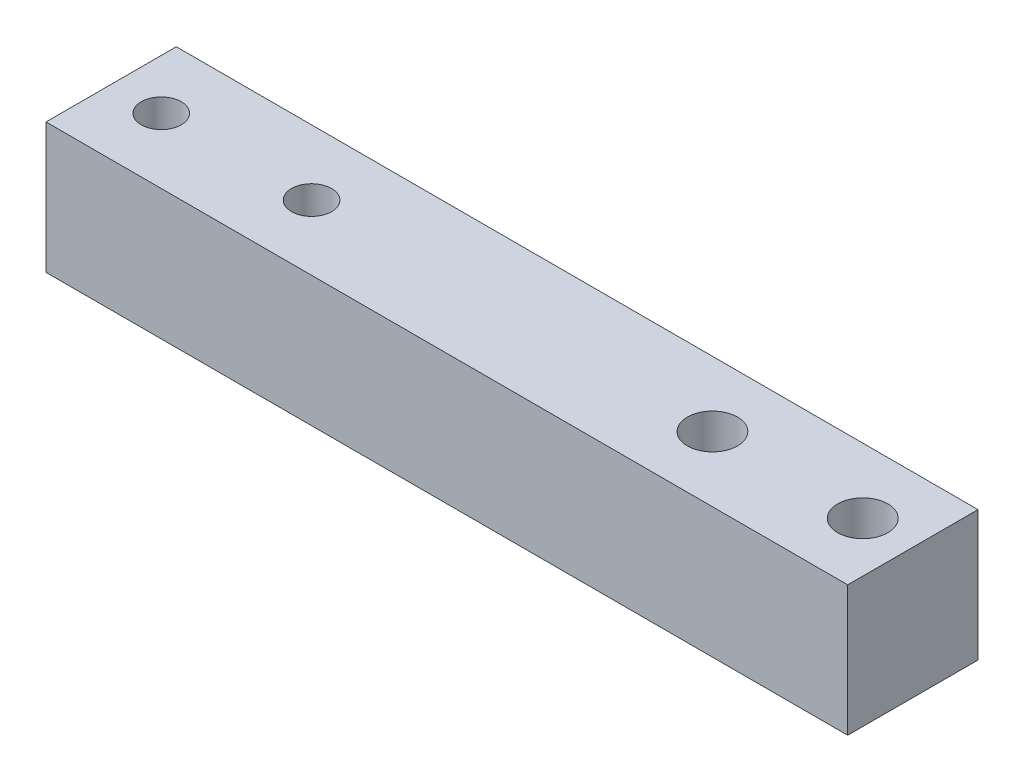
ISO-10303-21;
HEADER;
FILE_DESCRIPTION(('STEP AP214'),'2;1');
FILE_NAME('part.step','',(''),(''),'','','');
FILE_SCHEMA(('AUTOMOTIVE_DESIGN { 1 0 10303 214 1 1 1 1 }'));
ENDSEC;
DATA;
#1=APPLICATION_CONTEXT('core data for automotive mechanical design processes');
#2=APPLICATION_PROTOCOL_DEFINITION('international standard','automotive_design',2000,#1);
#3=PRODUCT_CONTEXT('',#1,'mechanical');
#4=PRODUCT('Part','Part','',(#3));
#5=PRODUCT_RELATED_PRODUCT_CATEGORY('part','',(#4));
#6=PRODUCT_DEFINITION_FORMATION('','',#4);
#7=PRODUCT_DEFINITION_CONTEXT('part definition',#1,'design');
#8=PRODUCT_DEFINITION('design','',#6,#7);
#9=PRODUCT_DEFINITION_SHAPE('','',#8);
#10=(LENGTH_UNIT() NAMED_UNIT(*) SI_UNIT(.MILLI.,.METRE.));
#11=(NAMED_UNIT(*) PLANE_ANGLE_UNIT() SI_UNIT($,.RADIAN.));
#12=(NAMED_UNIT(*) SI_UNIT($,.STERADIAN.) SOLID_ANGLE_UNIT());
#13=UNCERTAINTY_MEASURE_WITH_UNIT(LENGTH_MEASURE(1.E-05),#10,'distance_accuracy_value','');
#14=(GEOMETRIC_REPRESENTATION_CONTEXT(3) GLOBAL_UNCERTAINTY_ASSIGNED_CONTEXT((#13)) GLOBAL_UNIT_ASSIGNED_CONTEXT((#10,
#11,#12)) REPRESENTATION_CONTEXT('',''));
#15=CARTESIAN_POINT('',(0.,0.,0.));
#16=DIRECTION('',(0.,0.,1.));
#17=DIRECTION('',(1.,0.,0.));
#18=AXIS2_PLACEMENT_3D('',#15,#16,#17);
#19=CARTESIAN_POINT('',(-2.54263335131816,1.52234206471495,13.));
#20=DIRECTION('',(1.,0.,0.));
#21=DIRECTION('',(0.,1.,0.));
#22=AXIS2_PLACEMENT_3D('',#19,#20,#21);
#23=PLANE('',#22);
#24=DIRECTION('',(0.,-1.,0.));
#25=VECTOR('',#24,1.);
#26=CARTESIAN_POINT('',(-2.54263335131816,1.52234206471495,0.));
#27=LINE('',#26,#25);
#28=CARTESIAN_POINT('',(-2.54263335131816,1.52234206471495,0.));
#29=VERTEX_POINT('',#28);
#30=CARTESIAN_POINT('',(-2.54263335131816,-11.4776579352851,0.));
#31=VERTEX_POINT('',#30);
#32=EDGE_CURVE('E107',#29,#31,#27,.T.);
#33=ORIENTED_EDGE('',*,*,#32,.T.);
#34=DIRECTION('',(0.,0.,-1.));
#35=VECTOR('',#34,1.);
#36=CARTESIAN_POINT('',(-2.54263335131816,-11.4776579352851,13.));
#37=LINE('',#36,#35);
#38=CARTESIAN_POINT('',(-2.54263335131816,-11.4776579352851,13.));
#39=VERTEX_POINT('',#38);
#40=EDGE_CURVE('E11',#39,#31,#37,.T.);
#41=ORIENTED_EDGE('',*,*,#40,.F.);
#42=DIRECTION('',(0.,-1.,0.));
#43=VECTOR('',#42,1.);
#44=CARTESIAN_POINT('',(-2.54263335131816,1.52234206471495,13.));
#45=LINE('',#44,#43);
#46=CARTESIAN_POINT('',(-2.54263335131816,1.52234206471495,13.));
#47=VERTEX_POINT('',#46);
#48=EDGE_CURVE('E91',#47,#39,#45,.T.);
#49=ORIENTED_EDGE('',*,*,#48,.F.);
#50=DIRECTION('',(0.,0.,-1.));
#51=VECTOR('',#50,1.);
#52=CARTESIAN_POINT('',(-2.54263335131816,1.52234206471495,13.));
#53=LINE('',#52,#51);
#54=EDGE_CURVE('E103',#47,#29,#53,.T.);
#55=ORIENTED_EDGE('',*,*,#54,.T.);
#56=EDGE_LOOP('',(#33,#41,#49,#55));
#57=FACE_BOUND('',#56,.T.);
#58=ADVANCED_FACE('F39',(#57),#23,.F.);
#59=CARTESIAN_POINT('',(-2.54263335131816,-11.4776579352851,13.));
#60=DIRECTION('',(0.,1.,0.));
#61=DIRECTION('',(0.,0.,1.));
#62=AXIS2_PLACEMENT_3D('',#59,#60,#61);
#63=PLANE('',#62);
#64=CARTESIAN_POINT('',(2.45736664868185,-11.4776579352851,6.5));
#65=DIRECTION('',(0.,1.,0.));
#66=DIRECTION('',(0.,0.,1.));
#67=AXIS2_PLACEMENT_3D('',#64,#65,#66);
#68=CIRCLE('',#67,2.);
#69=CARTESIAN_POINT('',(2.45736664868185,-11.4776579352851,8.5));
#70=VERTEX_POINT('',#69);
#71=EDGE_CURVE('E136',#70,#70,#68,.T.);
#72=ORIENTED_EDGE('',*,*,#71,.T.);
#73=EDGE_LOOP('',(#72));
#74=FACE_BOUND('',#73,.T.);
#75=CARTESIAN_POINT('',(57.4573666486818,-11.4776579352851,6.5));
#76=DIRECTION('',(0.,1.,0.));
#77=DIRECTION('',(0.,0.,1.));
#78=AXIS2_PLACEMENT_3D('',#75,#76,#77);
#79=CIRCLE('',#78,2.5);
#80=CARTESIAN_POINT('',(57.4573666486818,-11.4776579352851,9.));
#81=VERTEX_POINT('',#80);
#82=EDGE_CURVE('E144',#81,#81,#79,.T.);
#83=ORIENTED_EDGE('',*,*,#82,.T.);
#84=EDGE_LOOP('',(#83));
#85=FACE_BOUND('',#84,.T.);
#86=CARTESIAN_POINT('',(72.4573666486818,-11.4776579352851,6.5));
#87=DIRECTION('',(0.,1.,0.));
#88=DIRECTION('',(0.,0.,1.));
#89=AXIS2_PLACEMENT_3D('',#86,#87,#88);
#90=CIRCLE('',#89,2.50000000000001);
#91=CARTESIAN_POINT('',(72.4573666486818,-11.4776579352851,9.00000000000001));
#92=VERTEX_POINT('',#91);
#93=EDGE_CURVE('E152',#92,#92,#90,.T.);
#94=ORIENTED_EDGE('',*,*,#93,.T.);
#95=EDGE_LOOP('',(#94));
#96=FACE_BOUND('',#95,.T.);
#97=CARTESIAN_POINT('',(17.4573666486818,-11.4776579352851,6.5));
#98=DIRECTION('',(0.,1.,0.));
#99=DIRECTION('',(0.,0.,1.));
#100=AXIS2_PLACEMENT_3D('',#97,#98,#99);
#101=CIRCLE('',#100,2.);
#102=CARTESIAN_POINT('',(17.4573666486818,-11.4776579352851,8.5));
#103=VERTEX_POINT('',#102);
#104=EDGE_CURVE('E111',#103,#103,#101,.T.);
#105=ORIENTED_EDGE('',*,*,#104,.T.);
#106=EDGE_LOOP('',(#105));
#107=FACE_BOUND('',#106,.T.);
#108=DIRECTION('',(1.,0.,0.));
#109=VECTOR('',#108,1.);
#110=CARTESIAN_POINT('',(-2.54263335131816,-11.4776579352851,0.));
#111=LINE('',#110,#109);
#112=CARTESIAN_POINT('',(77.4573666486818,-11.4776579352851,0.));
#113=VERTEX_POINT('',#112);
#114=EDGE_CURVE('E96',#31,#113,#111,.T.);
#115=ORIENTED_EDGE('',*,*,#114,.T.);
#116=DIRECTION('',(0.,0.,-1.));
#117=VECTOR('',#116,1.);
#118=CARTESIAN_POINT('',(77.4573666486818,-11.4776579352851,13.));
#119=LINE('',#118,#117);
#120=CARTESIAN_POINT('',(77.4573666486818,-11.4776579352851,13.));
#121=VERTEX_POINT('',#120);
#122=EDGE_CURVE('E48',#121,#113,#119,.T.);
#123=ORIENTED_EDGE('',*,*,#122,.F.);
#124=DIRECTION('',(1.,0.,0.));
#125=VECTOR('',#124,1.);
#126=CARTESIAN_POINT('',(-2.54263335131816,-11.4776579352851,13.));
#127=LINE('',#126,#125);
#128=EDGE_CURVE('E86',#39,#121,#127,.T.);
#129=ORIENTED_EDGE('',*,*,#128,.F.);
#130=ORIENTED_EDGE('',*,*,#40,.T.);
#131=EDGE_LOOP('',(#115,#123,#129,#130));
#132=FACE_BOUND('',#131,.T.);
#133=ADVANCED_FACE('F95',(#74,#85,#96,#107,#132),#63,.F.);
#134=CARTESIAN_POINT('',(77.4573666486818,1.52234206471495,13.));
#135=DIRECTION('',(-1.,0.,0.));
#136=DIRECTION('',(0.,0.,1.));
#137=AXIS2_PLACEMENT_3D('',#134,#135,#136);
#138=PLANE('',#137);
#139=DIRECTION('',(0.,1.,0.));
#140=VECTOR('',#139,1.);
#141=CARTESIAN_POINT('',(77.4573666486818,1.52234206471495,0.));
#142=LINE('',#141,#140);
#143=CARTESIAN_POINT('',(77.4573666486818,1.52234206471495,0.));
#144=VERTEX_POINT('',#143);
#145=EDGE_CURVE('E73',#113,#144,#142,.T.);
#146=ORIENTED_EDGE('',*,*,#145,.T.);
#147=DIRECTION('',(0.,0.,-1.));
#148=VECTOR('',#147,1.);
#149=CARTESIAN_POINT('',(77.4573666486818,1.52234206471495,13.));
#150=LINE('',#149,#148);
#151=CARTESIAN_POINT('',(77.4573666486818,1.52234206471495,13.));
#152=VERTEX_POINT('',#151);
#153=EDGE_CURVE('E98',#152,#144,#150,.T.);
#154=ORIENTED_EDGE('',*,*,#153,.F.);
#155=DIRECTION('',(0.,1.,0.));
#156=VECTOR('',#155,1.);
#157=CARTESIAN_POINT('',(77.4573666486818,1.52234206471495,13.));
#158=LINE('',#157,#156);
#159=EDGE_CURVE('E89',#121,#152,#158,.T.);
#160=ORIENTED_EDGE('',*,*,#159,.F.);
#161=ORIENTED_EDGE('',*,*,#122,.T.);
#162=EDGE_LOOP('',(#146,#154,#160,#161));
#163=FACE_BOUND('',#162,.T.);
#164=ADVANCED_FACE('F99',(#163),#138,.F.);
#165=CARTESIAN_POINT('',(-2.54263335131816,1.52234206471495,13.));
#166=DIRECTION('',(0.,-1.,0.));
#167=DIRECTION('',(0.,0.,-1.));
#168=AXIS2_PLACEMENT_3D('',#165,#166,#167);
#169=PLANE('',#168);
#170=CARTESIAN_POINT('',(2.45736664868185,1.52234206471495,6.5));
#171=DIRECTION('',(0.,1.,0.));
#172=DIRECTION('',(0.,0.,1.));
#173=AXIS2_PLACEMENT_3D('',#170,#171,#172);
#174=CIRCLE('',#173,2.);
#175=CARTESIAN_POINT('',(2.45736664868185,1.52234206471495,8.5));
#176=VERTEX_POINT('',#175);
#177=EDGE_CURVE('E140',#176,#176,#174,.T.);
#178=ORIENTED_EDGE('',*,*,#177,.F.);
#179=EDGE_LOOP('',(#178));
#180=FACE_BOUND('',#179,.T.);
#181=CARTESIAN_POINT('',(57.4573666486818,1.52234206471495,6.5));
#182=DIRECTION('',(0.,1.,0.));
#183=DIRECTION('',(0.,0.,1.));
#184=AXIS2_PLACEMENT_3D('',#181,#182,#183);
#185=CIRCLE('',#184,2.5);
#186=CARTESIAN_POINT('',(57.4573666486818,1.52234206471495,9.));
#187=VERTEX_POINT('',#186);
#188=EDGE_CURVE('E148',#187,#187,#185,.T.);
#189=ORIENTED_EDGE('',*,*,#188,.F.);
#190=EDGE_LOOP('',(#189));
#191=FACE_BOUND('',#190,.T.);
#192=CARTESIAN_POINT('',(72.4573666486818,1.52234206471495,6.5));
#193=DIRECTION('',(0.,1.,0.));
#194=DIRECTION('',(0.,0.,1.));
#195=AXIS2_PLACEMENT_3D('',#192,#193,#194);
#196=CIRCLE('',#195,2.50000000000001);
#197=CARTESIAN_POINT('',(72.4573666486818,1.52234206471495,9.00000000000001));
#198=VERTEX_POINT('',#197);
#199=EDGE_CURVE('E132',#198,#198,#196,.T.);
#200=ORIENTED_EDGE('',*,*,#199,.F.);
#201=EDGE_LOOP('',(#200));
#202=FACE_BOUND('',#201,.T.);
#203=CARTESIAN_POINT('',(17.4573666486818,1.52234206471495,6.5));
#204=DIRECTION('',(0.,1.,0.));
#205=DIRECTION('',(0.,0.,1.));
#206=AXIS2_PLACEMENT_3D('',#203,#204,#205);
#207=CIRCLE('',#206,2.);
#208=CARTESIAN_POINT('',(17.4573666486818,1.52234206471495,8.5));
#209=VERTEX_POINT('',#208);
#210=EDGE_CURVE('E128',#209,#209,#207,.T.);
#211=ORIENTED_EDGE('',*,*,#210,.F.);
#212=EDGE_LOOP('',(#211));
#213=FACE_BOUND('',#212,.T.);
#214=DIRECTION('',(-1.,0.,0.));
#215=VECTOR('',#214,1.);
#216=CARTESIAN_POINT('',(-2.54263335131816,1.52234206471495,0.));
#217=LINE('',#216,#215);
#218=EDGE_CURVE('E79',#144,#29,#217,.T.);
#219=ORIENTED_EDGE('',*,*,#218,.T.);
#220=ORIENTED_EDGE('',*,*,#54,.F.);
#221=DIRECTION('',(-1.,0.,0.));
#222=VECTOR('',#221,1.);
#223=CARTESIAN_POINT('',(-2.54263335131816,1.52234206471495,13.));
#224=LINE('',#223,#222);
#225=EDGE_CURVE('E56',#152,#47,#224,.T.);
#226=ORIENTED_EDGE('',*,*,#225,.F.);
#227=ORIENTED_EDGE('',*,*,#153,.T.);
#228=EDGE_LOOP('',(#219,#220,#226,#227));
#229=FACE_BOUND('',#228,.T.);
#230=ADVANCED_FACE('F121',(#180,#191,#202,#213,#229),#169,.F.);
#231=CARTESIAN_POINT('',(0.,0.,13.));
#232=DIRECTION('',(0.,0.,1.));
#233=DIRECTION('',(1.,0.,0.));
#234=AXIS2_PLACEMENT_3D('',#231,#232,#233);
#235=PLANE('',#234);
#236=ORIENTED_EDGE('',*,*,#48,.T.);
#237=ORIENTED_EDGE('',*,*,#128,.T.);
#238=ORIENTED_EDGE('',*,*,#159,.T.);
#239=ORIENTED_EDGE('',*,*,#225,.T.);
#240=EDGE_LOOP('',(#236,#237,#238,#239));
#241=FACE_BOUND('',#240,.T.);
#242=ADVANCED_FACE('F87',(#241),#235,.T.);
#243=CARTESIAN_POINT('',(0.,0.,0.));
#244=DIRECTION('',(0.,0.,1.));
#245=DIRECTION('',(1.,0.,0.));
#246=AXIS2_PLACEMENT_3D('',#243,#244,#245);
#247=PLANE('',#246);
#248=ORIENTED_EDGE('',*,*,#32,.F.);
#249=ORIENTED_EDGE('',*,*,#218,.F.);
#250=ORIENTED_EDGE('',*,*,#145,.F.);
#251=ORIENTED_EDGE('',*,*,#114,.F.);
#252=EDGE_LOOP('',(#248,#249,#250,#251));
#253=FACE_BOUND('',#252,.T.);
#254=ADVANCED_FACE('F124',(#253),#247,.F.);
#255=CARTESIAN_POINT('',(17.4573666486818,-11.4776579352851,6.5));
#256=DIRECTION('',(0.,1.,0.));
#257=DIRECTION('',(0.,0.,1.));
#258=AXIS2_PLACEMENT_3D('',#255,#256,#257);
#259=CYLINDRICAL_SURFACE('',#258,2.);
#260=ORIENTED_EDGE('',*,*,#104,.F.);
#261=EDGE_LOOP('',(#260));
#262=FACE_BOUND('',#261,.T.);
#263=ORIENTED_EDGE('',*,*,#210,.T.);
#264=EDGE_LOOP('',(#263));
#265=FACE_BOUND('',#264,.T.);
#266=ADVANCED_FACE('F168',(#262,#265),#259,.F.);
#267=CARTESIAN_POINT('',(72.4573666486818,-11.4776579352851,6.5));
#268=DIRECTION('',(0.,1.,0.));
#269=DIRECTION('',(0.,0.,1.));
#270=AXIS2_PLACEMENT_3D('',#267,#268,#269);
#271=CYLINDRICAL_SURFACE('',#270,2.50000000000001);
#272=ORIENTED_EDGE('',*,*,#93,.F.);
#273=EDGE_LOOP('',(#272));
#274=FACE_BOUND('',#273,.T.);
#275=ORIENTED_EDGE('',*,*,#199,.T.);
#276=EDGE_LOOP('',(#275));
#277=FACE_BOUND('',#276,.T.);
#278=ADVANCED_FACE('F160',(#274,#277),#271,.F.);
#279=CARTESIAN_POINT('',(57.4573666486818,-11.4776579352851,6.5));
#280=DIRECTION('',(0.,1.,0.));
#281=DIRECTION('',(0.,0.,1.));
#282=AXIS2_PLACEMENT_3D('',#279,#280,#281);
#283=CYLINDRICAL_SURFACE('',#282,2.5);
#284=ORIENTED_EDGE('',*,*,#82,.F.);
#285=EDGE_LOOP('',(#284));
#286=FACE_BOUND('',#285,.T.);
#287=ORIENTED_EDGE('',*,*,#188,.T.);
#288=EDGE_LOOP('',(#287));
#289=FACE_BOUND('',#288,.T.);
#290=ADVANCED_FACE('F176',(#286,#289),#283,.F.);
#291=CARTESIAN_POINT('',(2.45736664868185,-11.4776579352851,6.5));
#292=DIRECTION('',(0.,1.,0.));
#293=DIRECTION('',(0.,0.,1.));
#294=AXIS2_PLACEMENT_3D('',#291,#292,#293);
#295=CYLINDRICAL_SURFACE('',#294,2.);
#296=ORIENTED_EDGE('',*,*,#71,.F.);
#297=EDGE_LOOP('',(#296));
#298=FACE_BOUND('',#297,.T.);
#299=ORIENTED_EDGE('',*,*,#177,.T.);
#300=EDGE_LOOP('',(#299));
#301=FACE_BOUND('',#300,.T.);
#302=ADVANCED_FACE('F232',(#298,#301),#295,.F.);
#303=CLOSED_SHELL('',(#58,#133,#164,#230,#242,#254,#266,#278,#290,#302));
#304=MANIFOLD_SOLID_BREP('B2',#303);
#305=ADVANCED_BREP_SHAPE_REPRESENTATION('',(#18,#304),#14);
#306=SHAPE_DEFINITION_REPRESENTATION(#9,#305);
ENDSEC;
END-ISO-10303-21;
